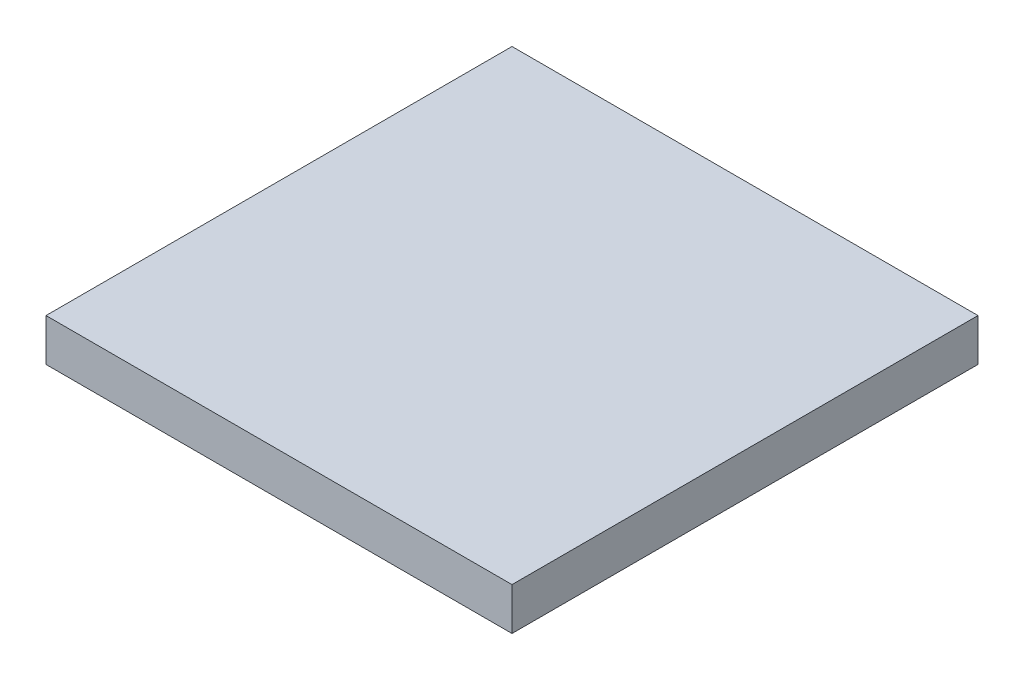
ISO-10303-21;
HEADER;
FILE_DESCRIPTION(('STEP AP214'),'2;1');
FILE_NAME('part.step','',(''),(''),'','','');
FILE_SCHEMA(('AUTOMOTIVE_DESIGN { 1 0 10303 214 1 1 1 1 }'));
ENDSEC;
DATA;
#1=APPLICATION_CONTEXT('core data for automotive mechanical design processes');
#2=APPLICATION_PROTOCOL_DEFINITION('international standard','automotive_design',2000,#1);
#3=PRODUCT_CONTEXT('',#1,'mechanical');
#4=PRODUCT('Part','Part','',(#3));
#5=PRODUCT_RELATED_PRODUCT_CATEGORY('part','',(#4));
#6=PRODUCT_DEFINITION_FORMATION('','',#4);
#7=PRODUCT_DEFINITION_CONTEXT('part definition',#1,'design');
#8=PRODUCT_DEFINITION('design','',#6,#7);
#9=PRODUCT_DEFINITION_SHAPE('','',#8);
#10=(LENGTH_UNIT() NAMED_UNIT(*) SI_UNIT(.MILLI.,.METRE.));
#11=(NAMED_UNIT(*) PLANE_ANGLE_UNIT() SI_UNIT($,.RADIAN.));
#12=(NAMED_UNIT(*) SI_UNIT($,.STERADIAN.) SOLID_ANGLE_UNIT());
#13=UNCERTAINTY_MEASURE_WITH_UNIT(LENGTH_MEASURE(1.E-05),#10,'distance_accuracy_value','');
#14=(GEOMETRIC_REPRESENTATION_CONTEXT(3) GLOBAL_UNCERTAINTY_ASSIGNED_CONTEXT((#13)) GLOBAL_UNIT_ASSIGNED_CONTEXT((#10,
#11,#12)) REPRESENTATION_CONTEXT('',''));
#15=CARTESIAN_POINT('',(0.,0.,0.));
#16=DIRECTION('',(0.,0.,1.));
#17=DIRECTION('',(1.,0.,0.));
#18=AXIS2_PLACEMENT_3D('',#15,#16,#17);
#19=CARTESIAN_POINT('',(0.,50.,0.));
#20=DIRECTION('',(1.,0.,0.));
#21=DIRECTION('',(0.,0.,-1.));
#22=AXIS2_PLACEMENT_3D('',#19,#20,#21);
#23=PLANE('',#22);
#24=DIRECTION('',(0.,0.,1.));
#25=VECTOR('',#24,1.);
#26=CARTESIAN_POINT('',(0.,0.,0.));
#27=LINE('',#26,#25);
#28=CARTESIAN_POINT('',(0.,0.,-550.));
#29=VERTEX_POINT('',#28);
#30=CARTESIAN_POINT('',(0.,0.,0.));
#31=VERTEX_POINT('',#30);
#32=EDGE_CURVE('E101',#29,#31,#27,.T.);
#33=ORIENTED_EDGE('',*,*,#32,.T.);
#34=DIRECTION('',(0.,-1.,0.));
#35=VECTOR('',#34,1.);
#36=CARTESIAN_POINT('',(0.,50.,0.));
#37=LINE('',#36,#35);
#38=CARTESIAN_POINT('',(0.,50.,0.));
#39=VERTEX_POINT('',#38);
#40=EDGE_CURVE('E11',#39,#31,#37,.T.);
#41=ORIENTED_EDGE('',*,*,#40,.F.);
#42=DIRECTION('',(0.,0.,1.));
#43=VECTOR('',#42,1.);
#44=CARTESIAN_POINT('',(0.,50.,0.));
#45=LINE('',#44,#43);
#46=CARTESIAN_POINT('',(0.,50.,-550.));
#47=VERTEX_POINT('',#46);
#48=EDGE_CURVE('E89',#47,#39,#45,.T.);
#49=ORIENTED_EDGE('',*,*,#48,.F.);
#50=DIRECTION('',(0.,-1.,0.));
#51=VECTOR('',#50,1.);
#52=CARTESIAN_POINT('',(0.,50.,-550.));
#53=LINE('',#52,#51);
#54=EDGE_CURVE('E97',#47,#29,#53,.T.);
#55=ORIENTED_EDGE('',*,*,#54,.T.);
#56=EDGE_LOOP('',(#33,#41,#49,#55));
#57=FACE_BOUND('',#56,.T.);
#58=ADVANCED_FACE('F38',(#57),#23,.F.);
#59=CARTESIAN_POINT('',(0.,50.,0.));
#60=DIRECTION('',(0.,0.,-1.));
#61=DIRECTION('',(-1.,0.,0.));
#62=AXIS2_PLACEMENT_3D('',#59,#60,#61);
#63=PLANE('',#62);
#64=DIRECTION('',(1.,0.,0.));
#65=VECTOR('',#64,1.);
#66=CARTESIAN_POINT('',(0.,0.,0.));
#67=LINE('',#66,#65);
#68=CARTESIAN_POINT('',(550.,0.,0.));
#69=VERTEX_POINT('',#68);
#70=EDGE_CURVE('E93',#31,#69,#67,.T.);
#71=ORIENTED_EDGE('',*,*,#70,.T.);
#72=DIRECTION('',(0.,-1.,0.));
#73=VECTOR('',#72,1.);
#74=CARTESIAN_POINT('',(550.,50.,0.));
#75=LINE('',#74,#73);
#76=CARTESIAN_POINT('',(550.,50.,0.));
#77=VERTEX_POINT('',#76);
#78=EDGE_CURVE('E46',#77,#69,#75,.T.);
#79=ORIENTED_EDGE('',*,*,#78,.F.);
#80=DIRECTION('',(1.,0.,0.));
#81=VECTOR('',#80,1.);
#82=CARTESIAN_POINT('',(0.,50.,0.));
#83=LINE('',#82,#81);
#84=EDGE_CURVE('E84',#39,#77,#83,.T.);
#85=ORIENTED_EDGE('',*,*,#84,.F.);
#86=ORIENTED_EDGE('',*,*,#40,.T.);
#87=EDGE_LOOP('',(#71,#79,#85,#86));
#88=FACE_BOUND('',#87,.T.);
#89=ADVANCED_FACE('F92',(#88),#63,.F.);
#90=CARTESIAN_POINT('',(550.,50.,0.));
#91=DIRECTION('',(-1.,0.,0.));
#92=DIRECTION('',(0.,0.,1.));
#93=AXIS2_PLACEMENT_3D('',#90,#91,#92);
#94=PLANE('',#93);
#95=DIRECTION('',(0.,0.,-1.));
#96=VECTOR('',#95,1.);
#97=CARTESIAN_POINT('',(550.,0.,0.));
#98=LINE('',#97,#96);
#99=CARTESIAN_POINT('',(550.,0.,-550.));
#100=VERTEX_POINT('',#99);
#101=EDGE_CURVE('E71',#69,#100,#98,.T.);
#102=ORIENTED_EDGE('',*,*,#101,.T.);
#103=DIRECTION('',(0.,-1.,0.));
#104=VECTOR('',#103,1.);
#105=CARTESIAN_POINT('',(550.,50.,-550.));
#106=LINE('',#105,#104);
#107=CARTESIAN_POINT('',(550.,50.,-550.));
#108=VERTEX_POINT('',#107);
#109=EDGE_CURVE('E94',#108,#100,#106,.T.);
#110=ORIENTED_EDGE('',*,*,#109,.F.);
#111=DIRECTION('',(0.,0.,-1.));
#112=VECTOR('',#111,1.);
#113=CARTESIAN_POINT('',(550.,50.,0.));
#114=LINE('',#113,#112);
#115=EDGE_CURVE('E87',#77,#108,#114,.T.);
#116=ORIENTED_EDGE('',*,*,#115,.F.);
#117=ORIENTED_EDGE('',*,*,#78,.T.);
#118=EDGE_LOOP('',(#102,#110,#116,#117));
#119=FACE_BOUND('',#118,.T.);
#120=ADVANCED_FACE('F95',(#119),#94,.F.);
#121=CARTESIAN_POINT('',(0.,50.,-550.));
#122=DIRECTION('',(0.,0.,1.));
#123=DIRECTION('',(1.,0.,0.));
#124=AXIS2_PLACEMENT_3D('',#121,#122,#123);
#125=PLANE('',#124);
#126=DIRECTION('',(-1.,0.,0.));
#127=VECTOR('',#126,1.);
#128=CARTESIAN_POINT('',(0.,0.,-550.));
#129=LINE('',#128,#127);
#130=EDGE_CURVE('E77',#100,#29,#129,.T.);
#131=ORIENTED_EDGE('',*,*,#130,.T.);
#132=ORIENTED_EDGE('',*,*,#54,.F.);
#133=DIRECTION('',(-1.,0.,0.));
#134=VECTOR('',#133,1.);
#135=CARTESIAN_POINT('',(0.,50.,-550.));
#136=LINE('',#135,#134);
#137=EDGE_CURVE('E54',#108,#47,#136,.T.);
#138=ORIENTED_EDGE('',*,*,#137,.F.);
#139=ORIENTED_EDGE('',*,*,#109,.T.);
#140=EDGE_LOOP('',(#131,#132,#138,#139));
#141=FACE_BOUND('',#140,.T.);
#142=ADVANCED_FACE('F108',(#141),#125,.F.);
#143=CARTESIAN_POINT('',(0.,50.,0.));
#144=DIRECTION('',(0.,-1.,0.));
#145=DIRECTION('',(0.,0.,-1.));
#146=AXIS2_PLACEMENT_3D('',#143,#144,#145);
#147=PLANE('',#146);
#148=ORIENTED_EDGE('',*,*,#48,.T.);
#149=ORIENTED_EDGE('',*,*,#84,.T.);
#150=ORIENTED_EDGE('',*,*,#115,.T.);
#151=ORIENTED_EDGE('',*,*,#137,.T.);
#152=EDGE_LOOP('',(#148,#149,#150,#151));
#153=FACE_BOUND('',#152,.T.);
#154=ADVANCED_FACE('F85',(#153),#147,.F.);
#155=CARTESIAN_POINT('',(0.,0.,0.));
#156=DIRECTION('',(0.,-1.,0.));
#157=DIRECTION('',(0.,0.,-1.));
#158=AXIS2_PLACEMENT_3D('',#155,#156,#157);
#159=PLANE('',#158);
#160=ORIENTED_EDGE('',*,*,#32,.F.);
#161=ORIENTED_EDGE('',*,*,#130,.F.);
#162=ORIENTED_EDGE('',*,*,#101,.F.);
#163=ORIENTED_EDGE('',*,*,#70,.F.);
#164=EDGE_LOOP('',(#160,#161,#162,#163));
#165=FACE_BOUND('',#164,.T.);
#166=ADVANCED_FACE('F111',(#165),#159,.T.);
#167=CLOSED_SHELL('',(#58,#89,#120,#142,#154,#166));
#168=MANIFOLD_SOLID_BREP('B2',#167);
#169=ADVANCED_BREP_SHAPE_REPRESENTATION('',(#18,#168),#14);
#170=SHAPE_DEFINITION_REPRESENTATION(#9,#169);
ENDSEC;
END-ISO-10303-21;
